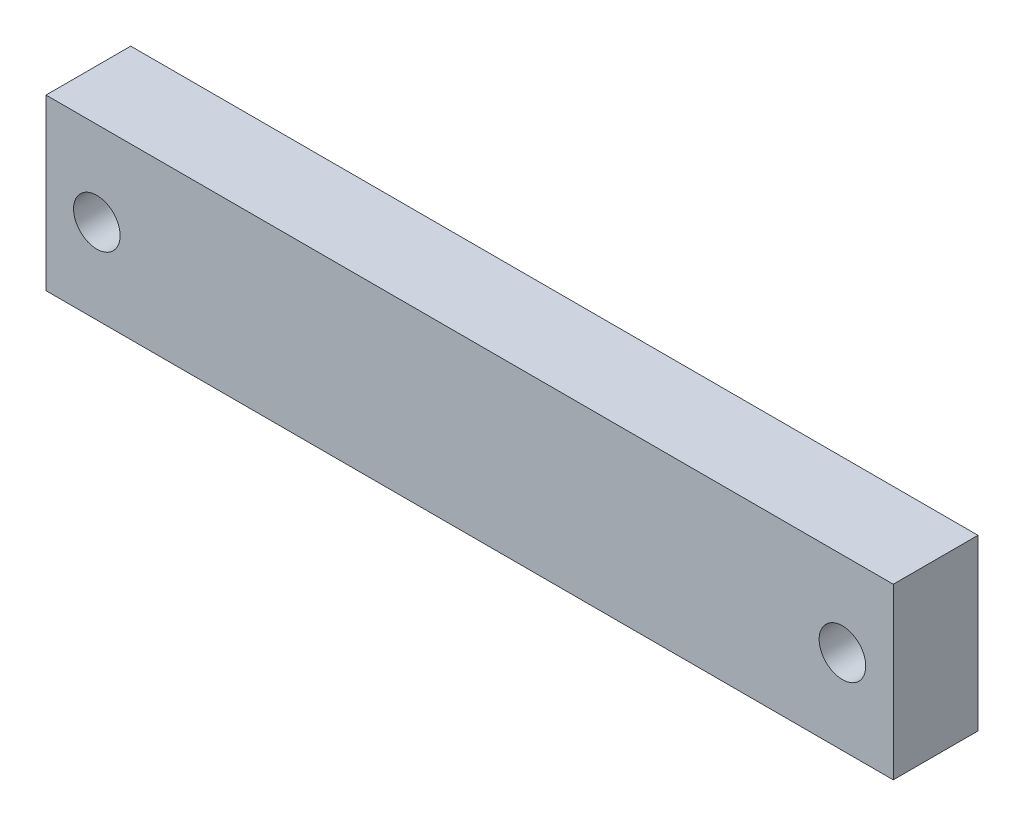
ISO-10303-21;
HEADER;
FILE_DESCRIPTION(('STEP AP214'),'2;1');
FILE_NAME('part.step','',(''),(''),'','','');
FILE_SCHEMA(('AUTOMOTIVE_DESIGN { 1 0 10303 214 1 1 1 1 }'));
ENDSEC;
DATA;
#1=APPLICATION_CONTEXT('core data for automotive mechanical design processes');
#2=APPLICATION_PROTOCOL_DEFINITION('international standard','automotive_design',2000,#1);
#3=PRODUCT_CONTEXT('',#1,'mechanical');
#4=PRODUCT('Part','Part','',(#3));
#5=PRODUCT_RELATED_PRODUCT_CATEGORY('part','',(#4));
#6=PRODUCT_DEFINITION_FORMATION('','',#4);
#7=PRODUCT_DEFINITION_CONTEXT('part definition',#1,'design');
#8=PRODUCT_DEFINITION('design','',#6,#7);
#9=PRODUCT_DEFINITION_SHAPE('','',#8);
#10=(LENGTH_UNIT() NAMED_UNIT(*) SI_UNIT(.MILLI.,.METRE.));
#11=(NAMED_UNIT(*) PLANE_ANGLE_UNIT() SI_UNIT($,.RADIAN.));
#12=(NAMED_UNIT(*) SI_UNIT($,.STERADIAN.) SOLID_ANGLE_UNIT());
#13=UNCERTAINTY_MEASURE_WITH_UNIT(LENGTH_MEASURE(1.E-05),#10,'distance_accuracy_value','');
#14=(GEOMETRIC_REPRESENTATION_CONTEXT(3) GLOBAL_UNCERTAINTY_ASSIGNED_CONTEXT((#13)) GLOBAL_UNIT_ASSIGNED_CONTEXT((#10,
#11,#12)) REPRESENTATION_CONTEXT('',''));
#15=CARTESIAN_POINT('',(0.,0.,0.));
#16=DIRECTION('',(0.,0.,1.));
#17=DIRECTION('',(1.,0.,0.));
#18=AXIS2_PLACEMENT_3D('',#15,#16,#17);
#19=CARTESIAN_POINT('',(100.,20.,0.));
#20=DIRECTION('',(0.,1.,0.));
#21=DIRECTION('',(0.,0.,1.));
#22=AXIS2_PLACEMENT_3D('',#19,#20,#21);
#23=PLANE('',#22);
#24=DIRECTION('',(-1.,0.,0.));
#25=VECTOR('',#24,1.);
#26=CARTESIAN_POINT('',(100.,20.,10.));
#27=LINE('',#26,#25);
#28=CARTESIAN_POINT('',(100.,20.,10.));
#29=VERTEX_POINT('',#28);
#30=CARTESIAN_POINT('',(0.,20.,10.));
#31=VERTEX_POINT('',#30);
#32=EDGE_CURVE('E98',#29,#31,#27,.T.);
#33=ORIENTED_EDGE('',*,*,#32,.F.);
#34=DIRECTION('',(0.,0.,1.));
#35=VECTOR('',#34,1.);
#36=CARTESIAN_POINT('',(100.,20.,0.));
#37=LINE('',#36,#35);
#38=CARTESIAN_POINT('',(100.,20.,0.));
#39=VERTEX_POINT('',#38);
#40=EDGE_CURVE('E11',#39,#29,#37,.T.);
#41=ORIENTED_EDGE('',*,*,#40,.F.);
#42=DIRECTION('',(-1.,0.,0.));
#43=VECTOR('',#42,1.);
#44=CARTESIAN_POINT('',(100.,20.,0.));
#45=LINE('',#44,#43);
#46=CARTESIAN_POINT('',(0.,20.,0.));
#47=VERTEX_POINT('',#46);
#48=EDGE_CURVE('E91',#39,#47,#45,.T.);
#49=ORIENTED_EDGE('',*,*,#48,.T.);
#50=DIRECTION('',(0.,0.,1.));
#51=VECTOR('',#50,1.);
#52=CARTESIAN_POINT('',(0.,20.,0.));
#53=LINE('',#52,#51);
#54=EDGE_CURVE('E36',#47,#31,#53,.T.);
#55=ORIENTED_EDGE('',*,*,#54,.T.);
#56=EDGE_LOOP('',(#33,#41,#49,#55));
#57=FACE_BOUND('',#56,.T.);
#58=ADVANCED_FACE('F33',(#57),#23,.T.);
#59=CARTESIAN_POINT('',(100.,0.,0.));
#60=DIRECTION('',(1.,0.,0.));
#61=DIRECTION('',(0.,0.,-1.));
#62=AXIS2_PLACEMENT_3D('',#59,#60,#61);
#63=PLANE('',#62);
#64=DIRECTION('',(0.,1.,0.));
#65=VECTOR('',#64,1.);
#66=CARTESIAN_POINT('',(100.,0.,10.));
#67=LINE('',#66,#65);
#68=CARTESIAN_POINT('',(100.,0.,10.));
#69=VERTEX_POINT('',#68);
#70=EDGE_CURVE('E93',#69,#29,#67,.T.);
#71=ORIENTED_EDGE('',*,*,#70,.F.);
#72=DIRECTION('',(0.,0.,1.));
#73=VECTOR('',#72,1.);
#74=CARTESIAN_POINT('',(100.,0.,0.));
#75=LINE('',#74,#73);
#76=CARTESIAN_POINT('',(100.,0.,0.));
#77=VERTEX_POINT('',#76);
#78=EDGE_CURVE('E42',#77,#69,#75,.T.);
#79=ORIENTED_EDGE('',*,*,#78,.F.);
#80=DIRECTION('',(0.,1.,0.));
#81=VECTOR('',#80,1.);
#82=CARTESIAN_POINT('',(100.,0.,0.));
#83=LINE('',#82,#81);
#84=EDGE_CURVE('E88',#77,#39,#83,.T.);
#85=ORIENTED_EDGE('',*,*,#84,.T.);
#86=ORIENTED_EDGE('',*,*,#40,.T.);
#87=EDGE_LOOP('',(#71,#79,#85,#86));
#88=FACE_BOUND('',#87,.T.);
#89=ADVANCED_FACE('F109',(#88),#63,.T.);
#90=CARTESIAN_POINT('',(0.,0.,0.));
#91=DIRECTION('',(0.,-1.,0.));
#92=DIRECTION('',(0.,0.,-1.));
#93=AXIS2_PLACEMENT_3D('',#90,#91,#92);
#94=PLANE('',#93);
#95=DIRECTION('',(1.,0.,0.));
#96=VECTOR('',#95,1.);
#97=CARTESIAN_POINT('',(0.,0.,10.));
#98=LINE('',#97,#96);
#99=CARTESIAN_POINT('',(0.,0.,10.));
#100=VERTEX_POINT('',#99);
#101=EDGE_CURVE('E83',#100,#69,#98,.T.);
#102=ORIENTED_EDGE('',*,*,#101,.F.);
#103=DIRECTION('',(0.,0.,1.));
#104=VECTOR('',#103,1.);
#105=CARTESIAN_POINT('',(0.,0.,0.));
#106=LINE('',#105,#104);
#107=CARTESIAN_POINT('',(0.,0.,0.));
#108=VERTEX_POINT('',#107);
#109=EDGE_CURVE('E78',#108,#100,#106,.T.);
#110=ORIENTED_EDGE('',*,*,#109,.F.);
#111=DIRECTION('',(1.,0.,0.));
#112=VECTOR('',#111,1.);
#113=CARTESIAN_POINT('',(0.,0.,0.));
#114=LINE('',#113,#112);
#115=EDGE_CURVE('E81',#108,#77,#114,.T.);
#116=ORIENTED_EDGE('',*,*,#115,.T.);
#117=ORIENTED_EDGE('',*,*,#78,.T.);
#118=EDGE_LOOP('',(#102,#110,#116,#117));
#119=FACE_BOUND('',#118,.T.);
#120=ADVANCED_FACE('F80',(#119),#94,.T.);
#121=CARTESIAN_POINT('',(0.,20.,0.));
#122=DIRECTION('',(-1.,0.,0.));
#123=DIRECTION('',(0.,0.,1.));
#124=AXIS2_PLACEMENT_3D('',#121,#122,#123);
#125=PLANE('',#124);
#126=DIRECTION('',(0.,-1.,0.));
#127=VECTOR('',#126,1.);
#128=CARTESIAN_POINT('',(0.,20.,10.));
#129=LINE('',#128,#127);
#130=EDGE_CURVE('E101',#31,#100,#129,.T.);
#131=ORIENTED_EDGE('',*,*,#130,.F.);
#132=ORIENTED_EDGE('',*,*,#54,.F.);
#133=DIRECTION('',(0.,-1.,0.));
#134=VECTOR('',#133,1.);
#135=CARTESIAN_POINT('',(0.,20.,0.));
#136=LINE('',#135,#134);
#137=EDGE_CURVE('E87',#47,#108,#136,.T.);
#138=ORIENTED_EDGE('',*,*,#137,.T.);
#139=ORIENTED_EDGE('',*,*,#109,.T.);
#140=EDGE_LOOP('',(#131,#132,#138,#139));
#141=FACE_BOUND('',#140,.T.);
#142=ADVANCED_FACE('F90',(#141),#125,.T.);
#143=CARTESIAN_POINT('',(0.,0.,0.));
#144=DIRECTION('',(0.,0.,1.));
#145=DIRECTION('',(1.,0.,0.));
#146=AXIS2_PLACEMENT_3D('',#143,#144,#145);
#147=PLANE('',#146);
#148=CARTESIAN_POINT('',(6.00000000000002,10.,0.));
#149=DIRECTION('',(0.,0.,1.));
#150=DIRECTION('',(1.,0.,0.));
#151=AXIS2_PLACEMENT_3D('',#148,#149,#150);
#152=CIRCLE('',#151,2.75);
#153=CARTESIAN_POINT('',(8.75000000000002,10.,0.));
#154=VERTEX_POINT('',#153);
#155=EDGE_CURVE('E142',#154,#154,#152,.T.);
#156=ORIENTED_EDGE('',*,*,#155,.T.);
#157=EDGE_LOOP('',(#156));
#158=FACE_BOUND('',#157,.T.);
#159=CARTESIAN_POINT('',(94.,10.,0.));
#160=DIRECTION('',(0.,0.,1.));
#161=DIRECTION('',(1.,0.,0.));
#162=AXIS2_PLACEMENT_3D('',#159,#160,#161);
#163=CIRCLE('',#162,2.75);
#164=CARTESIAN_POINT('',(96.75,10.,0.));
#165=VERTEX_POINT('',#164);
#166=EDGE_CURVE('E102',#165,#165,#163,.T.);
#167=ORIENTED_EDGE('',*,*,#166,.T.);
#168=EDGE_LOOP('',(#167));
#169=FACE_BOUND('',#168,.T.);
#170=ORIENTED_EDGE('',*,*,#48,.F.);
#171=ORIENTED_EDGE('',*,*,#84,.F.);
#172=ORIENTED_EDGE('',*,*,#115,.F.);
#173=ORIENTED_EDGE('',*,*,#137,.F.);
#174=EDGE_LOOP('',(#170,#171,#172,#173));
#175=FACE_BOUND('',#174,.T.);
#176=ADVANCED_FACE('F86',(#158,#169,#175),#147,.F.);
#177=CARTESIAN_POINT('',(0.,0.,10.));
#178=DIRECTION('',(0.,0.,1.));
#179=DIRECTION('',(1.,0.,0.));
#180=AXIS2_PLACEMENT_3D('',#177,#178,#179);
#181=PLANE('',#180);
#182=CARTESIAN_POINT('',(6.00000000000002,10.,10.));
#183=DIRECTION('',(0.,0.,1.));
#184=DIRECTION('',(1.,0.,0.));
#185=AXIS2_PLACEMENT_3D('',#182,#183,#184);
#186=CIRCLE('',#185,2.75);
#187=CARTESIAN_POINT('',(8.75000000000002,10.,10.));
#188=VERTEX_POINT('',#187);
#189=EDGE_CURVE('E145',#188,#188,#186,.T.);
#190=ORIENTED_EDGE('',*,*,#189,.F.);
#191=EDGE_LOOP('',(#190));
#192=FACE_BOUND('',#191,.T.);
#193=CARTESIAN_POINT('',(94.,10.,10.));
#194=DIRECTION('',(0.,0.,1.));
#195=DIRECTION('',(1.,0.,0.));
#196=AXIS2_PLACEMENT_3D('',#193,#194,#195);
#197=CIRCLE('',#196,2.75);
#198=CARTESIAN_POINT('',(96.75,10.,10.));
#199=VERTEX_POINT('',#198);
#200=EDGE_CURVE('E147',#199,#199,#197,.T.);
#201=ORIENTED_EDGE('',*,*,#200,.F.);
#202=EDGE_LOOP('',(#201));
#203=FACE_BOUND('',#202,.T.);
#204=ORIENTED_EDGE('',*,*,#32,.T.);
#205=ORIENTED_EDGE('',*,*,#130,.T.);
#206=ORIENTED_EDGE('',*,*,#101,.T.);
#207=ORIENTED_EDGE('',*,*,#70,.T.);
#208=EDGE_LOOP('',(#204,#205,#206,#207));
#209=FACE_BOUND('',#208,.T.);
#210=ADVANCED_FACE('F108',(#192,#203,#209),#181,.T.);
#211=CARTESIAN_POINT('',(94.,10.,0.));
#212=DIRECTION('',(0.,0.,1.));
#213=DIRECTION('',(1.,0.,0.));
#214=AXIS2_PLACEMENT_3D('',#211,#212,#213);
#215=CYLINDRICAL_SURFACE('',#214,2.75);
#216=ORIENTED_EDGE('',*,*,#166,.F.);
#217=EDGE_LOOP('',(#216));
#218=FACE_BOUND('',#217,.T.);
#219=ORIENTED_EDGE('',*,*,#200,.T.);
#220=EDGE_LOOP('',(#219));
#221=FACE_BOUND('',#220,.T.);
#222=ADVANCED_FACE('F127',(#218,#221),#215,.F.);
#223=CARTESIAN_POINT('',(6.00000000000002,10.,0.));
#224=DIRECTION('',(0.,0.,1.));
#225=DIRECTION('',(1.,0.,0.));
#226=AXIS2_PLACEMENT_3D('',#223,#224,#225);
#227=CYLINDRICAL_SURFACE('',#226,2.75);
#228=ORIENTED_EDGE('',*,*,#155,.F.);
#229=EDGE_LOOP('',(#228));
#230=FACE_BOUND('',#229,.T.);
#231=ORIENTED_EDGE('',*,*,#189,.T.);
#232=EDGE_LOOP('',(#231));
#233=FACE_BOUND('',#232,.T.);
#234=ADVANCED_FACE('F134',(#230,#233),#227,.F.);
#235=CLOSED_SHELL('',(#58,#89,#120,#142,#176,#210,#222,#234));
#236=MANIFOLD_SOLID_BREP('B2',#235);
#237=ADVANCED_BREP_SHAPE_REPRESENTATION('',(#18,#236),#14);
#238=SHAPE_DEFINITION_REPRESENTATION(#9,#237);
ENDSEC;
END-ISO-10303-21;
